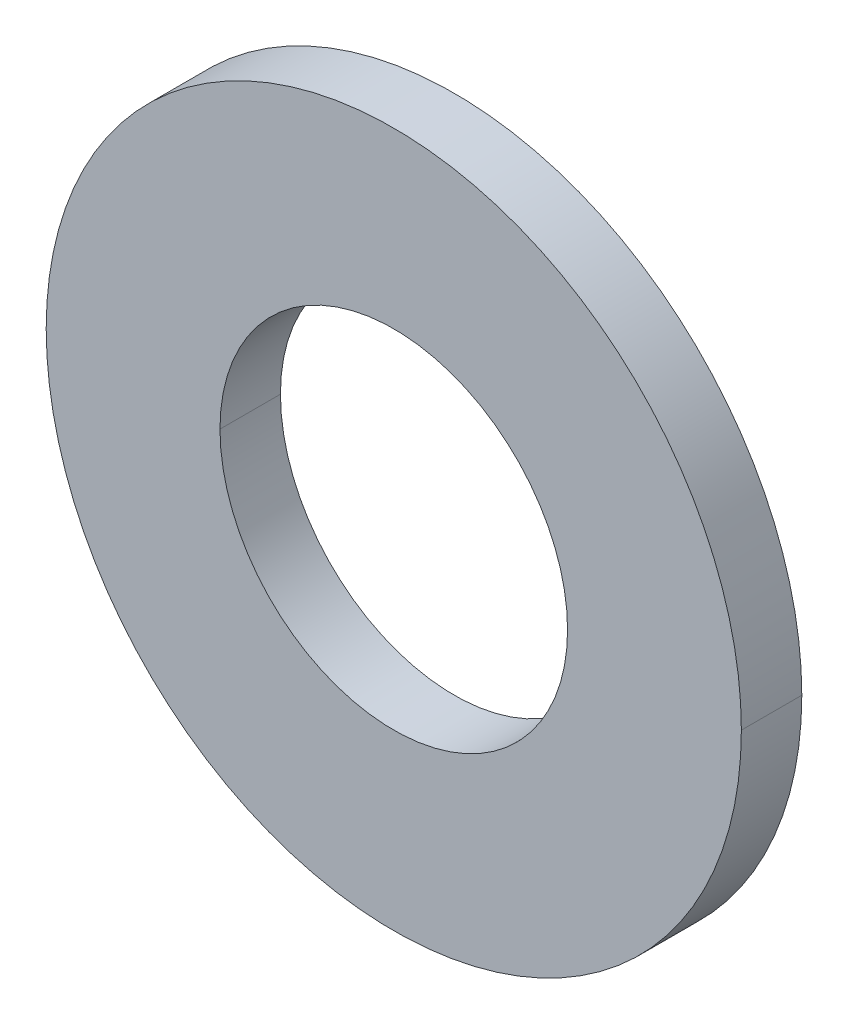
ISO-10303-21;
HEADER;
FILE_DESCRIPTION(('STEP AP214'),'2;1');
FILE_NAME('part.step','',(''),(''),'','','');
FILE_SCHEMA(('AUTOMOTIVE_DESIGN { 1 0 10303 214 1 1 1 1 }'));
ENDSEC;
DATA;
#1=APPLICATION_CONTEXT('core data for automotive mechanical design processes');
#2=APPLICATION_PROTOCOL_DEFINITION('international standard','automotive_design',2000,#1);
#3=PRODUCT_CONTEXT('',#1,'mechanical');
#4=PRODUCT('Part','Part','',(#3));
#5=PRODUCT_RELATED_PRODUCT_CATEGORY('part','',(#4));
#6=PRODUCT_DEFINITION_FORMATION('','',#4);
#7=PRODUCT_DEFINITION_CONTEXT('part definition',#1,'design');
#8=PRODUCT_DEFINITION('design','',#6,#7);
#9=PRODUCT_DEFINITION_SHAPE('','',#8);
#10=(LENGTH_UNIT() NAMED_UNIT(*) SI_UNIT(.MILLI.,.METRE.));
#11=(NAMED_UNIT(*) PLANE_ANGLE_UNIT() SI_UNIT($,.RADIAN.));
#12=(NAMED_UNIT(*) SI_UNIT($,.STERADIAN.) SOLID_ANGLE_UNIT());
#13=UNCERTAINTY_MEASURE_WITH_UNIT(LENGTH_MEASURE(1.E-05),#10,'distance_accuracy_value','');
#14=(GEOMETRIC_REPRESENTATION_CONTEXT(3) GLOBAL_UNCERTAINTY_ASSIGNED_CONTEXT((#13)) GLOBAL_UNIT_ASSIGNED_CONTEXT((#10,
#11,#12)) REPRESENTATION_CONTEXT('',''));
#15=CARTESIAN_POINT('',(0.,0.,0.));
#16=DIRECTION('',(0.,0.,1.));
#17=DIRECTION('',(1.,0.,0.));
#18=AXIS2_PLACEMENT_3D('',#15,#16,#17);
#19=CARTESIAN_POINT('',(0.,0.,1.524));
#20=DIRECTION('',(0.,0.,-1.));
#21=DIRECTION('',(-1.,0.,0.));
#22=AXIS2_PLACEMENT_3D('',#19,#20,#21);
#23=CYLINDRICAL_SURFACE('',#22,4.3815);
#24=DIRECTION('',(0.,0.,-1.));
#25=VECTOR('',#24,1.);
#26=CARTESIAN_POINT('',(4.3815,0.,1.524));
#27=LINE('',#26,#25);
#28=CARTESIAN_POINT('',(4.3815,0.,1.524));
#29=VERTEX_POINT('',#28);
#30=CARTESIAN_POINT('',(4.3815,0.,0.));
#31=VERTEX_POINT('',#30);
#32=EDGE_CURVE('E76',#29,#31,#27,.T.);
#33=ORIENTED_EDGE('',*,*,#32,.F.);
#34=CARTESIAN_POINT('',(0.,0.,1.524));
#35=DIRECTION('',(0.,0.,1.));
#36=DIRECTION('',(1.,0.,0.));
#37=AXIS2_PLACEMENT_3D('',#34,#35,#36);
#38=CIRCLE('',#37,4.3815);
#39=CARTESIAN_POINT('',(-4.3815,0.,1.524));
#40=VERTEX_POINT('',#39);
#41=EDGE_CURVE('E71',#29,#40,#38,.T.);
#42=ORIENTED_EDGE('',*,*,#41,.T.);
#43=DIRECTION('',(0.,0.,-1.));
#44=VECTOR('',#43,1.);
#45=CARTESIAN_POINT('',(-4.3815,0.,1.524));
#46=LINE('',#45,#44);
#47=CARTESIAN_POINT('',(-4.3815,0.,0.));
#48=VERTEX_POINT('',#47);
#49=EDGE_CURVE('E73',#40,#48,#46,.T.);
#50=ORIENTED_EDGE('',*,*,#49,.T.);
#51=CARTESIAN_POINT('',(0.,0.,0.));
#52=DIRECTION('',(0.,0.,1.));
#53=DIRECTION('',(1.,0.,0.));
#54=AXIS2_PLACEMENT_3D('',#51,#52,#53);
#55=CIRCLE('',#54,4.3815);
#56=EDGE_CURVE('E11',#31,#48,#55,.T.);
#57=ORIENTED_EDGE('',*,*,#56,.F.);
#58=EDGE_LOOP('',(#33,#42,#50,#57));
#59=FACE_BOUND('',#58,.T.);
#60=ADVANCED_FACE('F16',(#59),#23,.F.);
#61=CARTESIAN_POINT('',(0.,0.,1.524));
#62=DIRECTION('',(0.,0.,-1.));
#63=DIRECTION('',(-1.,0.,0.));
#64=AXIS2_PLACEMENT_3D('',#61,#62,#63);
#65=CYLINDRICAL_SURFACE('',#64,8.763);
#66=DIRECTION('',(0.,0.,-1.));
#67=VECTOR('',#66,1.);
#68=CARTESIAN_POINT('',(8.763,0.,1.524));
#69=LINE('',#68,#67);
#70=CARTESIAN_POINT('',(8.763,0.,1.524));
#71=VERTEX_POINT('',#70);
#72=CARTESIAN_POINT('',(8.763,0.,0.));
#73=VERTEX_POINT('',#72);
#74=EDGE_CURVE('E106',#71,#73,#69,.T.);
#75=ORIENTED_EDGE('',*,*,#74,.F.);
#76=CARTESIAN_POINT('',(0.,0.,1.524));
#77=DIRECTION('',(0.,0.,1.));
#78=DIRECTION('',(1.,0.,0.));
#79=AXIS2_PLACEMENT_3D('',#76,#77,#78);
#80=CIRCLE('',#79,8.763);
#81=CARTESIAN_POINT('',(-8.763,0.,1.524));
#82=VERTEX_POINT('',#81);
#83=EDGE_CURVE('E81',#82,#71,#80,.T.);
#84=ORIENTED_EDGE('',*,*,#83,.F.);
#85=DIRECTION('',(0.,0.,-1.));
#86=VECTOR('',#85,1.);
#87=CARTESIAN_POINT('',(-8.763,0.,1.524));
#88=LINE('',#87,#86);
#89=CARTESIAN_POINT('',(-8.763,0.,0.));
#90=VERTEX_POINT('',#89);
#91=EDGE_CURVE('E109',#82,#90,#88,.T.);
#92=ORIENTED_EDGE('',*,*,#91,.T.);
#93=CARTESIAN_POINT('',(0.,0.,0.));
#94=DIRECTION('',(0.,0.,1.));
#95=DIRECTION('',(1.,0.,0.));
#96=AXIS2_PLACEMENT_3D('',#93,#94,#95);
#97=CIRCLE('',#96,8.763);
#98=EDGE_CURVE('E25',#90,#73,#97,.T.);
#99=ORIENTED_EDGE('',*,*,#98,.T.);
#100=EDGE_LOOP('',(#75,#84,#92,#99));
#101=FACE_BOUND('',#100,.T.);
#102=ADVANCED_FACE('F18',(#101),#65,.T.);
#103=CARTESIAN_POINT('',(0.,0.,0.));
#104=DIRECTION('',(0.,0.,1.));
#105=DIRECTION('',(1.,0.,0.));
#106=AXIS2_PLACEMENT_3D('',#103,#104,#105);
#107=PLANE('',#106);
#108=CARTESIAN_POINT('',(0.,0.,0.));
#109=DIRECTION('',(0.,0.,1.));
#110=DIRECTION('',(1.,0.,0.));
#111=AXIS2_PLACEMENT_3D('',#108,#109,#110);
#112=CIRCLE('',#111,4.3815);
#113=EDGE_CURVE('E87',#48,#31,#112,.T.);
#114=ORIENTED_EDGE('',*,*,#113,.T.);
#115=ORIENTED_EDGE('',*,*,#56,.T.);
#116=EDGE_LOOP('',(#114,#115));
#117=FACE_BOUND('',#116,.T.);
#118=ORIENTED_EDGE('',*,*,#98,.F.);
#119=CARTESIAN_POINT('',(0.,0.,0.));
#120=DIRECTION('',(0.,0.,1.));
#121=DIRECTION('',(1.,0.,0.));
#122=AXIS2_PLACEMENT_3D('',#119,#120,#121);
#123=CIRCLE('',#122,8.763);
#124=EDGE_CURVE('E113',#73,#90,#123,.T.);
#125=ORIENTED_EDGE('',*,*,#124,.F.);
#126=EDGE_LOOP('',(#118,#125));
#127=FACE_BOUND('',#126,.T.);
#128=ADVANCED_FACE('F208',(#117,#127),#107,.F.);
#129=CARTESIAN_POINT('',(0.,0.,1.524));
#130=DIRECTION('',(0.,0.,1.));
#131=DIRECTION('',(1.,0.,0.));
#132=AXIS2_PLACEMENT_3D('',#129,#130,#131);
#133=PLANE('',#132);
#134=CARTESIAN_POINT('',(0.,0.,1.524));
#135=DIRECTION('',(0.,0.,1.));
#136=DIRECTION('',(1.,0.,0.));
#137=AXIS2_PLACEMENT_3D('',#134,#135,#136);
#138=CIRCLE('',#137,4.3815);
#139=EDGE_CURVE('E85',#40,#29,#138,.T.);
#140=ORIENTED_EDGE('',*,*,#139,.F.);
#141=ORIENTED_EDGE('',*,*,#41,.F.);
#142=EDGE_LOOP('',(#140,#141));
#143=FACE_BOUND('',#142,.T.);
#144=ORIENTED_EDGE('',*,*,#83,.T.);
#145=CARTESIAN_POINT('',(0.,0.,1.524));
#146=DIRECTION('',(0.,0.,1.));
#147=DIRECTION('',(1.,0.,0.));
#148=AXIS2_PLACEMENT_3D('',#145,#146,#147);
#149=CIRCLE('',#148,8.763);
#150=EDGE_CURVE('E89',#71,#82,#149,.T.);
#151=ORIENTED_EDGE('',*,*,#150,.T.);
#152=EDGE_LOOP('',(#144,#151));
#153=FACE_BOUND('',#152,.T.);
#154=ADVANCED_FACE('F91',(#143,#153),#133,.T.);
#155=CARTESIAN_POINT('',(0.,0.,1.524));
#156=DIRECTION('',(0.,0.,-1.));
#157=DIRECTION('',(-1.,0.,0.));
#158=AXIS2_PLACEMENT_3D('',#155,#156,#157);
#159=CYLINDRICAL_SURFACE('',#158,8.763);
#160=ORIENTED_EDGE('',*,*,#150,.F.);
#161=ORIENTED_EDGE('',*,*,#74,.T.);
#162=ORIENTED_EDGE('',*,*,#124,.T.);
#163=ORIENTED_EDGE('',*,*,#91,.F.);
#164=EDGE_LOOP('',(#160,#161,#162,#163));
#165=FACE_BOUND('',#164,.T.);
#166=ADVANCED_FACE('F189',(#165),#159,.T.);
#167=CARTESIAN_POINT('',(0.,0.,1.524));
#168=DIRECTION('',(0.,0.,-1.));
#169=DIRECTION('',(-1.,0.,0.));
#170=AXIS2_PLACEMENT_3D('',#167,#168,#169);
#171=CYLINDRICAL_SURFACE('',#170,4.3815);
#172=ORIENTED_EDGE('',*,*,#139,.T.);
#173=ORIENTED_EDGE('',*,*,#32,.T.);
#174=ORIENTED_EDGE('',*,*,#113,.F.);
#175=ORIENTED_EDGE('',*,*,#49,.F.);
#176=EDGE_LOOP('',(#172,#173,#174,#175));
#177=FACE_BOUND('',#176,.T.);
#178=ADVANCED_FACE('F84',(#177),#171,.F.);
#179=CLOSED_SHELL('',(#60,#102,#128,#154,#166,#178));
#180=MANIFOLD_SOLID_BREP('B1',#179);
#181=ADVANCED_BREP_SHAPE_REPRESENTATION('',(#18,#180),#14);
#182=SHAPE_DEFINITION_REPRESENTATION(#9,#181);
ENDSEC;
END-ISO-10303-21;
